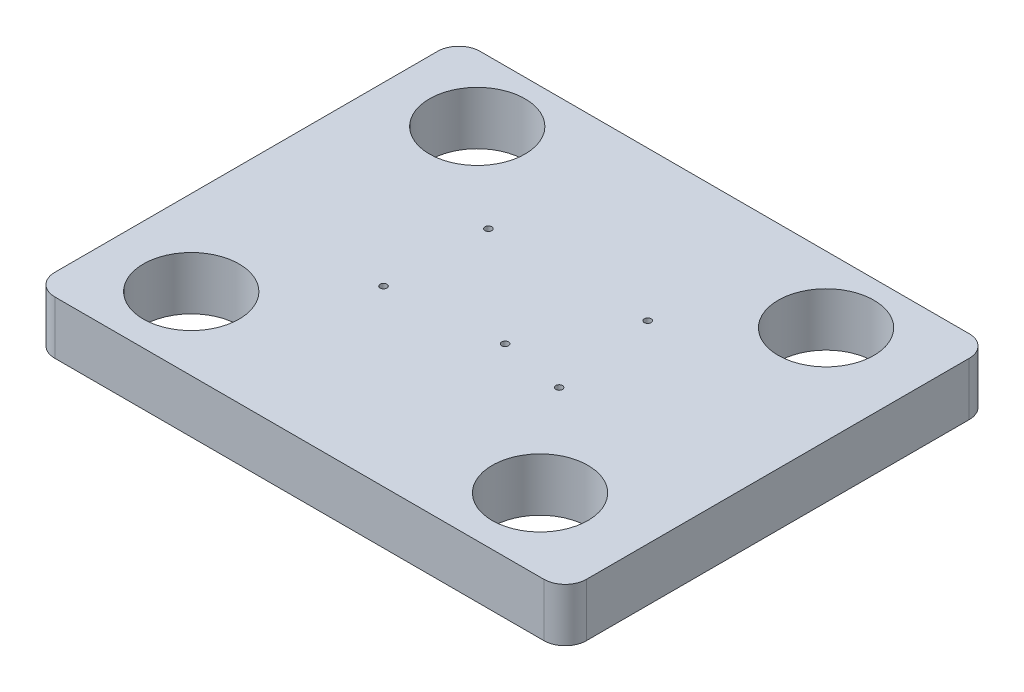
ISO-10303-21;
HEADER;
FILE_DESCRIPTION(('STEP AP214'),'2;1');
FILE_NAME('part.step','',(''),(''),'','','');
FILE_SCHEMA(('AUTOMOTIVE_DESIGN { 1 0 10303 214 1 1 1 1 }'));
ENDSEC;
DATA;
#1=APPLICATION_CONTEXT('core data for automotive mechanical design processes');
#2=APPLICATION_PROTOCOL_DEFINITION('international standard','automotive_design',2000,#1);
#3=PRODUCT_CONTEXT('',#1,'mechanical');
#4=PRODUCT('Part','Part','',(#3));
#5=PRODUCT_RELATED_PRODUCT_CATEGORY('part','',(#4));
#6=PRODUCT_DEFINITION_FORMATION('','',#4);
#7=PRODUCT_DEFINITION_CONTEXT('part definition',#1,'design');
#8=PRODUCT_DEFINITION('design','',#6,#7);
#9=PRODUCT_DEFINITION_SHAPE('','',#8);
#10=(LENGTH_UNIT() NAMED_UNIT(*) SI_UNIT(.MILLI.,.METRE.));
#11=(NAMED_UNIT(*) PLANE_ANGLE_UNIT() SI_UNIT($,.RADIAN.));
#12=(NAMED_UNIT(*) SI_UNIT($,.STERADIAN.) SOLID_ANGLE_UNIT());
#13=UNCERTAINTY_MEASURE_WITH_UNIT(LENGTH_MEASURE(1.E-05),#10,'distance_accuracy_value','');
#14=(GEOMETRIC_REPRESENTATION_CONTEXT(3) GLOBAL_UNCERTAINTY_ASSIGNED_CONTEXT((#13)) GLOBAL_UNIT_ASSIGNED_CONTEXT((#10,
#11,#12)) REPRESENTATION_CONTEXT('',''));
#15=CARTESIAN_POINT('',(0.,0.,0.));
#16=DIRECTION('',(0.,0.,1.));
#17=DIRECTION('',(1.,0.,0.));
#18=AXIS2_PLACEMENT_3D('',#15,#16,#17);
#19=CARTESIAN_POINT('',(9.99999999999995,25.,-190.));
#20=DIRECTION('',(0.,1.,0.));
#21=DIRECTION('',(0.,0.,1.));
#22=AXIS2_PLACEMENT_3D('',#19,#20,#21);
#23=CYLINDRICAL_SURFACE('',#22,10.);
#24=DIRECTION('',(0.,1.,0.));
#25=VECTOR('',#24,1.);
#26=CARTESIAN_POINT('',(9.99999999999995,25.,-200.));
#27=LINE('',#26,#25);
#28=CARTESIAN_POINT('',(9.99999999999995,0.,-200.));
#29=VERTEX_POINT('',#28);
#30=CARTESIAN_POINT('',(9.99999999999995,25.,-200.));
#31=VERTEX_POINT('',#30);
#32=EDGE_CURVE('E168',#29,#31,#27,.T.);
#33=ORIENTED_EDGE('',*,*,#32,.F.);
#34=CARTESIAN_POINT('',(9.99999999999995,0.,-190.));
#35=DIRECTION('',(0.,-1.,0.));
#36=DIRECTION('',(0.,0.,-1.));
#37=AXIS2_PLACEMENT_3D('',#34,#35,#36);
#38=CIRCLE('',#37,10.);
#39=CARTESIAN_POINT('',(0.,0.,-190.));
#40=VERTEX_POINT('',#39);
#41=EDGE_CURVE('E47',#40,#29,#38,.T.);
#42=ORIENTED_EDGE('',*,*,#41,.F.);
#43=DIRECTION('',(0.,1.,0.));
#44=VECTOR('',#43,1.);
#45=CARTESIAN_POINT('',(0.,25.,-190.));
#46=LINE('',#45,#44);
#47=CARTESIAN_POINT('',(0.,25.,-190.));
#48=VERTEX_POINT('',#47);
#49=EDGE_CURVE('E107',#48,#40,#46,.F.);
#50=ORIENTED_EDGE('',*,*,#49,.F.);
#51=CARTESIAN_POINT('',(9.99999999999995,25.,-190.));
#52=DIRECTION('',(0.,-1.,0.));
#53=DIRECTION('',(0.,0.,-1.));
#54=AXIS2_PLACEMENT_3D('',#51,#52,#53);
#55=CIRCLE('',#54,10.);
#56=EDGE_CURVE('E11',#31,#48,#55,.F.);
#57=ORIENTED_EDGE('',*,*,#56,.F.);
#58=EDGE_LOOP('',(#33,#42,#50,#57));
#59=FACE_BOUND('',#58,.T.);
#60=ADVANCED_FACE('F39',(#59),#23,.T.);
#61=CARTESIAN_POINT('',(240.,25.,-190.));
#62=DIRECTION('',(0.,1.,0.));
#63=DIRECTION('',(0.,0.,1.));
#64=AXIS2_PLACEMENT_3D('',#61,#62,#63);
#65=CYLINDRICAL_SURFACE('',#64,10.);
#66=DIRECTION('',(0.,1.,0.));
#67=VECTOR('',#66,1.);
#68=CARTESIAN_POINT('',(250.,25.,-190.));
#69=LINE('',#68,#67);
#70=CARTESIAN_POINT('',(250.,0.,-190.));
#71=VERTEX_POINT('',#70);
#72=CARTESIAN_POINT('',(250.,25.,-190.));
#73=VERTEX_POINT('',#72);
#74=EDGE_CURVE('E154',#71,#73,#69,.T.);
#75=ORIENTED_EDGE('',*,*,#74,.F.);
#76=CARTESIAN_POINT('',(240.,0.,-190.));
#77=DIRECTION('',(0.,-1.,0.));
#78=DIRECTION('',(0.,0.,-1.));
#79=AXIS2_PLACEMENT_3D('',#76,#77,#78);
#80=CIRCLE('',#79,10.);
#81=CARTESIAN_POINT('',(240.,0.,-200.));
#82=VERTEX_POINT('',#81);
#83=EDGE_CURVE('E162',#82,#71,#80,.T.);
#84=ORIENTED_EDGE('',*,*,#83,.F.);
#85=DIRECTION('',(0.,1.,0.));
#86=VECTOR('',#85,1.);
#87=CARTESIAN_POINT('',(240.,25.,-200.));
#88=LINE('',#87,#86);
#89=CARTESIAN_POINT('',(240.,25.,-200.));
#90=VERTEX_POINT('',#89);
#91=EDGE_CURVE('E158',#90,#82,#88,.F.);
#92=ORIENTED_EDGE('',*,*,#91,.F.);
#93=CARTESIAN_POINT('',(240.,25.,-190.));
#94=DIRECTION('',(0.,-1.,0.));
#95=DIRECTION('',(0.,0.,-1.));
#96=AXIS2_PLACEMENT_3D('',#93,#94,#95);
#97=CIRCLE('',#96,10.);
#98=EDGE_CURVE('E165',#73,#90,#97,.F.);
#99=ORIENTED_EDGE('',*,*,#98,.F.);
#100=EDGE_LOOP('',(#75,#84,#92,#99));
#101=FACE_BOUND('',#100,.T.);
#102=ADVANCED_FACE('F300',(#101),#65,.T.);
#103=CARTESIAN_POINT('',(240.,25.,-10.));
#104=DIRECTION('',(0.,1.,0.));
#105=DIRECTION('',(0.,0.,1.));
#106=AXIS2_PLACEMENT_3D('',#103,#104,#105);
#107=CYLINDRICAL_SURFACE('',#106,10.);
#108=DIRECTION('',(0.,1.,0.));
#109=VECTOR('',#108,1.);
#110=CARTESIAN_POINT('',(240.,25.,0.));
#111=LINE('',#110,#109);
#112=CARTESIAN_POINT('',(240.,0.,0.));
#113=VERTEX_POINT('',#112);
#114=CARTESIAN_POINT('',(240.,25.,0.));
#115=VERTEX_POINT('',#114);
#116=EDGE_CURVE('E140',#113,#115,#111,.T.);
#117=ORIENTED_EDGE('',*,*,#116,.F.);
#118=CARTESIAN_POINT('',(240.,0.,-10.));
#119=DIRECTION('',(0.,-1.,0.));
#120=DIRECTION('',(0.,0.,-1.));
#121=AXIS2_PLACEMENT_3D('',#118,#119,#120);
#122=CIRCLE('',#121,10.);
#123=CARTESIAN_POINT('',(250.,0.,-10.));
#124=VERTEX_POINT('',#123);
#125=EDGE_CURVE('E148',#124,#113,#122,.T.);
#126=ORIENTED_EDGE('',*,*,#125,.F.);
#127=DIRECTION('',(0.,1.,0.));
#128=VECTOR('',#127,1.);
#129=CARTESIAN_POINT('',(250.,25.,-10.));
#130=LINE('',#129,#128);
#131=CARTESIAN_POINT('',(250.,25.,-10.));
#132=VERTEX_POINT('',#131);
#133=EDGE_CURVE('E144',#132,#124,#130,.F.);
#134=ORIENTED_EDGE('',*,*,#133,.F.);
#135=CARTESIAN_POINT('',(240.,25.,-10.));
#136=DIRECTION('',(0.,-1.,0.));
#137=DIRECTION('',(0.,0.,-1.));
#138=AXIS2_PLACEMENT_3D('',#135,#136,#137);
#139=CIRCLE('',#138,10.);
#140=EDGE_CURVE('E151',#115,#132,#139,.F.);
#141=ORIENTED_EDGE('',*,*,#140,.F.);
#142=EDGE_LOOP('',(#117,#126,#134,#141));
#143=FACE_BOUND('',#142,.T.);
#144=ADVANCED_FACE('F304',(#143),#107,.T.);
#145=CARTESIAN_POINT('',(10.,25.,-10.));
#146=DIRECTION('',(0.,1.,0.));
#147=DIRECTION('',(0.,0.,1.));
#148=AXIS2_PLACEMENT_3D('',#145,#146,#147);
#149=CYLINDRICAL_SURFACE('',#148,10.);
#150=DIRECTION('',(0.,1.,0.));
#151=VECTOR('',#150,1.);
#152=CARTESIAN_POINT('',(0.,25.,-10.));
#153=LINE('',#152,#151);
#154=CARTESIAN_POINT('',(0.,0.,-10.));
#155=VERTEX_POINT('',#154);
#156=CARTESIAN_POINT('',(0.,25.,-10.));
#157=VERTEX_POINT('',#156);
#158=EDGE_CURVE('E106',#155,#157,#153,.T.);
#159=ORIENTED_EDGE('',*,*,#158,.F.);
#160=CARTESIAN_POINT('',(10.,0.,-10.));
#161=DIRECTION('',(0.,-1.,0.));
#162=DIRECTION('',(0.,0.,-1.));
#163=AXIS2_PLACEMENT_3D('',#160,#161,#162);
#164=CIRCLE('',#163,10.);
#165=CARTESIAN_POINT('',(10.,0.,0.));
#166=VERTEX_POINT('',#165);
#167=EDGE_CURVE('E114',#166,#155,#164,.T.);
#168=ORIENTED_EDGE('',*,*,#167,.F.);
#169=DIRECTION('',(0.,1.,0.));
#170=VECTOR('',#169,1.);
#171=CARTESIAN_POINT('',(10.,25.,0.));
#172=LINE('',#171,#170);
#173=CARTESIAN_POINT('',(10.,25.,0.));
#174=VERTEX_POINT('',#173);
#175=EDGE_CURVE('E122',#174,#166,#172,.F.);
#176=ORIENTED_EDGE('',*,*,#175,.F.);
#177=CARTESIAN_POINT('',(10.,25.,-10.));
#178=DIRECTION('',(0.,-1.,0.));
#179=DIRECTION('',(0.,0.,-1.));
#180=AXIS2_PLACEMENT_3D('',#177,#178,#179);
#181=CIRCLE('',#180,10.);
#182=EDGE_CURVE('E121',#157,#174,#181,.F.);
#183=ORIENTED_EDGE('',*,*,#182,.F.);
#184=EDGE_LOOP('',(#159,#168,#176,#183));
#185=FACE_BOUND('',#184,.T.);
#186=ADVANCED_FACE('F125',(#185),#149,.T.);
#187=CARTESIAN_POINT('',(0.,25.,0.));
#188=DIRECTION('',(1.,0.,0.));
#189=DIRECTION('',(0.,0.,-1.));
#190=AXIS2_PLACEMENT_3D('',#187,#188,#189);
#191=PLANE('',#190);
#192=DIRECTION('',(0.,0.,1.));
#193=VECTOR('',#192,1.);
#194=CARTESIAN_POINT('',(0.,25.,0.));
#195=LINE('',#194,#193);
#196=EDGE_CURVE('E181',#48,#157,#195,.T.);
#197=ORIENTED_EDGE('',*,*,#196,.F.);
#198=ORIENTED_EDGE('',*,*,#49,.T.);
#199=DIRECTION('',(0.,0.,1.));
#200=VECTOR('',#199,1.);
#201=CARTESIAN_POINT('',(0.,0.,0.));
#202=LINE('',#201,#200);
#203=EDGE_CURVE('E101',#40,#155,#202,.T.);
#204=ORIENTED_EDGE('',*,*,#203,.T.);
#205=ORIENTED_EDGE('',*,*,#158,.T.);
#206=EDGE_LOOP('',(#197,#198,#204,#205));
#207=FACE_BOUND('',#206,.T.);
#208=ADVANCED_FACE('F104',(#207),#191,.F.);
#209=CARTESIAN_POINT('',(0.,25.,0.));
#210=DIRECTION('',(0.,0.,-1.));
#211=DIRECTION('',(-1.,0.,0.));
#212=AXIS2_PLACEMENT_3D('',#209,#210,#211);
#213=PLANE('',#212);
#214=DIRECTION('',(1.,0.,0.));
#215=VECTOR('',#214,1.);
#216=CARTESIAN_POINT('',(0.,0.,0.));
#217=LINE('',#216,#215);
#218=EDGE_CURVE('E110',#166,#113,#217,.T.);
#219=ORIENTED_EDGE('',*,*,#218,.T.);
#220=ORIENTED_EDGE('',*,*,#116,.T.);
#221=DIRECTION('',(1.,0.,0.));
#222=VECTOR('',#221,1.);
#223=CARTESIAN_POINT('',(0.,25.,0.));
#224=LINE('',#223,#222);
#225=EDGE_CURVE('E185',#174,#115,#224,.T.);
#226=ORIENTED_EDGE('',*,*,#225,.F.);
#227=ORIENTED_EDGE('',*,*,#175,.T.);
#228=EDGE_LOOP('',(#219,#220,#226,#227));
#229=FACE_BOUND('',#228,.T.);
#230=ADVANCED_FACE('F307',(#229),#213,.F.);
#231=CARTESIAN_POINT('',(250.,25.,0.));
#232=DIRECTION('',(-1.,0.,0.));
#233=DIRECTION('',(0.,0.,1.));
#234=AXIS2_PLACEMENT_3D('',#231,#232,#233);
#235=PLANE('',#234);
#236=DIRECTION('',(0.,0.,-1.));
#237=VECTOR('',#236,1.);
#238=CARTESIAN_POINT('',(250.,0.,0.));
#239=LINE('',#238,#237);
#240=EDGE_CURVE('E182',#124,#71,#239,.T.);
#241=ORIENTED_EDGE('',*,*,#240,.T.);
#242=ORIENTED_EDGE('',*,*,#74,.T.);
#243=DIRECTION('',(0.,0.,-1.));
#244=VECTOR('',#243,1.);
#245=CARTESIAN_POINT('',(250.,25.,0.));
#246=LINE('',#245,#244);
#247=EDGE_CURVE('E132',#132,#73,#246,.T.);
#248=ORIENTED_EDGE('',*,*,#247,.F.);
#249=ORIENTED_EDGE('',*,*,#133,.T.);
#250=EDGE_LOOP('',(#241,#242,#248,#249));
#251=FACE_BOUND('',#250,.T.);
#252=ADVANCED_FACE('F308',(#251),#235,.F.);
#253=CARTESIAN_POINT('',(0.,25.,-200.));
#254=DIRECTION('',(0.,0.,1.));
#255=DIRECTION('',(1.,0.,0.));
#256=AXIS2_PLACEMENT_3D('',#253,#254,#255);
#257=PLANE('',#256);
#258=DIRECTION('',(-1.,0.,0.));
#259=VECTOR('',#258,1.);
#260=CARTESIAN_POINT('',(0.,0.,-200.));
#261=LINE('',#260,#259);
#262=EDGE_CURVE('E135',#82,#29,#261,.T.);
#263=ORIENTED_EDGE('',*,*,#262,.T.);
#264=ORIENTED_EDGE('',*,*,#32,.T.);
#265=DIRECTION('',(-1.,0.,0.));
#266=VECTOR('',#265,1.);
#267=CARTESIAN_POINT('',(0.,25.,-200.));
#268=LINE('',#267,#266);
#269=EDGE_CURVE('E127',#90,#31,#268,.T.);
#270=ORIENTED_EDGE('',*,*,#269,.F.);
#271=ORIENTED_EDGE('',*,*,#91,.T.);
#272=EDGE_LOOP('',(#263,#264,#270,#271));
#273=FACE_BOUND('',#272,.T.);
#274=ADVANCED_FACE('F178',(#273),#257,.F.);
#275=CARTESIAN_POINT('',(0.,25.,0.));
#276=DIRECTION('',(0.,-1.,0.));
#277=DIRECTION('',(0.,0.,-1.));
#278=AXIS2_PLACEMENT_3D('',#275,#276,#277);
#279=PLANE('',#278);
#280=CARTESIAN_POINT('',(39.9103974749629,25.,-168.750387859964));
#281=DIRECTION('',(0.,1.,0.));
#282=DIRECTION('',(0.,0.,1.));
#283=AXIS2_PLACEMENT_3D('',#280,#281,#282);
#284=CIRCLE('',#283,22.5);
#285=CARTESIAN_POINT('',(39.9103974749629,25.,-146.250387859964));
#286=VERTEX_POINT('',#285);
#287=EDGE_CURVE('E247',#286,#286,#284,.T.);
#288=ORIENTED_EDGE('',*,*,#287,.F.);
#289=EDGE_LOOP('',(#288));
#290=FACE_BOUND('',#289,.T.);
#291=CARTESIAN_POINT('',(39.9103974749629,25.,-34.2660825397425));
#292=DIRECTION('',(0.,1.,0.));
#293=DIRECTION('',(0.,0.,1.));
#294=AXIS2_PLACEMENT_3D('',#291,#292,#293);
#295=CIRCLE('',#294,22.5);
#296=CARTESIAN_POINT('',(39.9103974749629,25.,-11.7660825397425));
#297=VERTEX_POINT('',#296);
#298=EDGE_CURVE('E255',#297,#297,#295,.T.);
#299=ORIENTED_EDGE('',*,*,#298,.F.);
#300=EDGE_LOOP('',(#299));
#301=FACE_BOUND('',#300,.T.);
#302=CARTESIAN_POINT('',(203.930975458971,25.,-34.2660825397425));
#303=DIRECTION('',(0.,1.,0.));
#304=DIRECTION('',(0.,0.,1.));
#305=AXIS2_PLACEMENT_3D('',#302,#303,#304);
#306=CIRCLE('',#305,22.5);
#307=CARTESIAN_POINT('',(203.930975458971,25.,-11.7660825397425));
#308=VERTEX_POINT('',#307);
#309=EDGE_CURVE('E263',#308,#308,#306,.T.);
#310=ORIENTED_EDGE('',*,*,#309,.F.);
#311=EDGE_LOOP('',(#310));
#312=FACE_BOUND('',#311,.T.);
#313=CARTESIAN_POINT('',(203.930975458971,25.,-168.750387859964));
#314=DIRECTION('',(0.,1.,0.));
#315=DIRECTION('',(0.,0.,1.));
#316=AXIS2_PLACEMENT_3D('',#313,#314,#315);
#317=CIRCLE('',#316,22.5);
#318=CARTESIAN_POINT('',(203.930975458971,25.,-146.250387859964));
#319=VERTEX_POINT('',#318);
#320=EDGE_CURVE('E239',#319,#319,#317,.T.);
#321=ORIENTED_EDGE('',*,*,#320,.F.);
#322=EDGE_LOOP('',(#321));
#323=FACE_BOUND('',#322,.T.);
#324=CARTESIAN_POINT('',(134.983925072132,25.,-86.7560797353676));
#325=DIRECTION('',(0.,1.,0.));
#326=DIRECTION('',(0.,0.,1.));
#327=AXIS2_PLACEMENT_3D('',#324,#325,#326);
#328=CIRCLE('',#327,1.60000000000002);
#329=CARTESIAN_POINT('',(134.983925072132,25.,-85.1560797353676));
#330=VERTEX_POINT('',#329);
#331=EDGE_CURVE('E211',#330,#330,#328,.T.);
#332=ORIENTED_EDGE('',*,*,#331,.F.);
#333=EDGE_LOOP('',(#332));
#334=FACE_BOUND('',#333,.T.);
#335=CARTESIAN_POINT('',(165.463925072132,25.,-81.6760797353676));
#336=DIRECTION('',(0.,1.,0.));
#337=DIRECTION('',(0.,0.,1.));
#338=AXIS2_PLACEMENT_3D('',#335,#336,#337);
#339=CIRCLE('',#338,1.60000000000002);
#340=CARTESIAN_POINT('',(165.463925072132,25.,-80.0760797353676));
#341=VERTEX_POINT('',#340);
#342=EDGE_CURVE('E220',#341,#341,#339,.T.);
#343=ORIENTED_EDGE('',*,*,#342,.F.);
#344=EDGE_LOOP('',(#343));
#345=FACE_BOUND('',#344,.T.);
#346=CARTESIAN_POINT('',(159.113925072132,25.,-129.712061315759));
#347=DIRECTION('',(0.,1.,0.));
#348=DIRECTION('',(0.,0.,1.));
#349=AXIS2_PLACEMENT_3D('',#346,#347,#348);
#350=CIRCLE('',#349,1.59999999999999);
#351=CARTESIAN_POINT('',(159.113925072132,25.,-128.112061315759));
#352=VERTEX_POINT('',#351);
#353=EDGE_CURVE('E228',#352,#352,#350,.T.);
#354=ORIENTED_EDGE('',*,*,#353,.F.);
#355=EDGE_LOOP('',(#354));
#356=FACE_BOUND('',#355,.T.);
#357=CARTESIAN_POINT('',(84.1839250721321,25.,-129.712061315759));
#358=DIRECTION('',(0.,1.,0.));
#359=DIRECTION('',(0.,0.,1.));
#360=AXIS2_PLACEMENT_3D('',#357,#358,#359);
#361=CIRCLE('',#360,1.59999999999999);
#362=CARTESIAN_POINT('',(84.1839250721321,25.,-128.112061315759));
#363=VERTEX_POINT('',#362);
#364=EDGE_CURVE('E203',#363,#363,#361,.T.);
#365=ORIENTED_EDGE('',*,*,#364,.F.);
#366=EDGE_LOOP('',(#365));
#367=FACE_BOUND('',#366,.T.);
#368=CARTESIAN_POINT('',(82.9139250721321,25.,-81.6760797353676));
#369=DIRECTION('',(0.,1.,0.));
#370=DIRECTION('',(0.,0.,1.));
#371=AXIS2_PLACEMENT_3D('',#368,#369,#370);
#372=CIRCLE('',#371,1.59999999999999);
#373=CARTESIAN_POINT('',(82.9139250721321,25.,-80.0760797353676));
#374=VERTEX_POINT('',#373);
#375=EDGE_CURVE('E199',#374,#374,#372,.T.);
#376=ORIENTED_EDGE('',*,*,#375,.F.);
#377=EDGE_LOOP('',(#376));
#378=FACE_BOUND('',#377,.T.);
#379=ORIENTED_EDGE('',*,*,#269,.T.);
#380=ORIENTED_EDGE('',*,*,#56,.T.);
#381=ORIENTED_EDGE('',*,*,#196,.T.);
#382=ORIENTED_EDGE('',*,*,#182,.T.);
#383=ORIENTED_EDGE('',*,*,#225,.T.);
#384=ORIENTED_EDGE('',*,*,#140,.T.);
#385=ORIENTED_EDGE('',*,*,#247,.T.);
#386=ORIENTED_EDGE('',*,*,#98,.T.);
#387=EDGE_LOOP('',(#379,#380,#381,#382,#383,#384,#385,#386));
#388=FACE_BOUND('',#387,.T.);
#389=ADVANCED_FACE('F281',(#290,#301,#312,#323,#334,#345,#356,#367,#378,#388),#279,.F.);
#390=CARTESIAN_POINT('',(0.,0.,0.));
#391=DIRECTION('',(0.,-1.,0.));
#392=DIRECTION('',(0.,0.,-1.));
#393=AXIS2_PLACEMENT_3D('',#390,#391,#392);
#394=PLANE('',#393);
#395=CARTESIAN_POINT('',(39.9103974749629,0.,-168.750387859964));
#396=DIRECTION('',(0.,1.,0.));
#397=DIRECTION('',(0.,0.,1.));
#398=AXIS2_PLACEMENT_3D('',#395,#396,#397);
#399=CIRCLE('',#398,22.5);
#400=CARTESIAN_POINT('',(39.9103974749629,0.,-146.250387859964));
#401=VERTEX_POINT('',#400);
#402=EDGE_CURVE('E251',#401,#401,#399,.T.);
#403=ORIENTED_EDGE('',*,*,#402,.T.);
#404=EDGE_LOOP('',(#403));
#405=FACE_BOUND('',#404,.T.);
#406=CARTESIAN_POINT('',(39.9103974749629,0.,-34.2660825397425));
#407=DIRECTION('',(0.,1.,0.));
#408=DIRECTION('',(0.,0.,1.));
#409=AXIS2_PLACEMENT_3D('',#406,#407,#408);
#410=CIRCLE('',#409,22.5);
#411=CARTESIAN_POINT('',(39.9103974749629,0.,-11.7660825397425));
#412=VERTEX_POINT('',#411);
#413=EDGE_CURVE('E259',#412,#412,#410,.T.);
#414=ORIENTED_EDGE('',*,*,#413,.T.);
#415=EDGE_LOOP('',(#414));
#416=FACE_BOUND('',#415,.T.);
#417=CARTESIAN_POINT('',(203.930975458971,0.,-34.2660825397425));
#418=DIRECTION('',(0.,1.,0.));
#419=DIRECTION('',(0.,0.,1.));
#420=AXIS2_PLACEMENT_3D('',#417,#418,#419);
#421=CIRCLE('',#420,22.5);
#422=CARTESIAN_POINT('',(203.930975458971,0.,-11.7660825397425));
#423=VERTEX_POINT('',#422);
#424=EDGE_CURVE('E243',#423,#423,#421,.T.);
#425=ORIENTED_EDGE('',*,*,#424,.T.);
#426=EDGE_LOOP('',(#425));
#427=FACE_BOUND('',#426,.T.);
#428=CARTESIAN_POINT('',(203.930975458971,0.,-168.750387859964));
#429=DIRECTION('',(0.,1.,0.));
#430=DIRECTION('',(0.,0.,1.));
#431=AXIS2_PLACEMENT_3D('',#428,#429,#430);
#432=CIRCLE('',#431,22.5);
#433=CARTESIAN_POINT('',(203.930975458971,0.,-146.250387859964));
#434=VERTEX_POINT('',#433);
#435=EDGE_CURVE('E212',#434,#434,#432,.T.);
#436=ORIENTED_EDGE('',*,*,#435,.T.);
#437=EDGE_LOOP('',(#436));
#438=FACE_BOUND('',#437,.T.);
#439=CARTESIAN_POINT('',(134.983925072132,0.,-86.7560797353676));
#440=DIRECTION('',(0.,1.,0.));
#441=DIRECTION('',(0.,0.,1.));
#442=AXIS2_PLACEMENT_3D('',#439,#440,#441);
#443=CIRCLE('',#442,1.60000000000002);
#444=CARTESIAN_POINT('',(134.983925072132,0.,-85.1560797353676));
#445=VERTEX_POINT('',#444);
#446=EDGE_CURVE('E207',#445,#445,#443,.T.);
#447=ORIENTED_EDGE('',*,*,#446,.T.);
#448=EDGE_LOOP('',(#447));
#449=FACE_BOUND('',#448,.T.);
#450=CARTESIAN_POINT('',(165.463925072132,0.,-81.6760797353676));
#451=DIRECTION('',(0.,1.,0.));
#452=DIRECTION('',(0.,0.,1.));
#453=AXIS2_PLACEMENT_3D('',#450,#451,#452);
#454=CIRCLE('',#453,1.60000000000002);
#455=CARTESIAN_POINT('',(165.463925072132,0.,-80.0760797353676));
#456=VERTEX_POINT('',#455);
#457=EDGE_CURVE('E216',#456,#456,#454,.T.);
#458=ORIENTED_EDGE('',*,*,#457,.T.);
#459=EDGE_LOOP('',(#458));
#460=FACE_BOUND('',#459,.T.);
#461=CARTESIAN_POINT('',(159.113925072132,0.,-129.712061315759));
#462=DIRECTION('',(0.,1.,0.));
#463=DIRECTION('',(0.,0.,1.));
#464=AXIS2_PLACEMENT_3D('',#461,#462,#463);
#465=CIRCLE('',#464,1.59999999999999);
#466=CARTESIAN_POINT('',(159.113925072132,0.,-128.112061315759));
#467=VERTEX_POINT('',#466);
#468=EDGE_CURVE('E224',#467,#467,#465,.T.);
#469=ORIENTED_EDGE('',*,*,#468,.T.);
#470=EDGE_LOOP('',(#469));
#471=FACE_BOUND('',#470,.T.);
#472=CARTESIAN_POINT('',(84.1839250721321,0.,-129.712061315759));
#473=DIRECTION('',(0.,1.,0.));
#474=DIRECTION('',(0.,0.,1.));
#475=AXIS2_PLACEMENT_3D('',#472,#473,#474);
#476=CIRCLE('',#475,1.59999999999999);
#477=CARTESIAN_POINT('',(84.1839250721321,0.,-128.112061315759));
#478=VERTEX_POINT('',#477);
#479=EDGE_CURVE('E232',#478,#478,#476,.T.);
#480=ORIENTED_EDGE('',*,*,#479,.T.);
#481=EDGE_LOOP('',(#480));
#482=FACE_BOUND('',#481,.T.);
#483=CARTESIAN_POINT('',(82.9139250721321,0.,-81.6760797353676));
#484=DIRECTION('',(0.,1.,0.));
#485=DIRECTION('',(0.,0.,1.));
#486=AXIS2_PLACEMENT_3D('',#483,#484,#485);
#487=CIRCLE('',#486,1.59999999999999);
#488=CARTESIAN_POINT('',(82.9139250721321,0.,-80.0760797353676));
#489=VERTEX_POINT('',#488);
#490=EDGE_CURVE('E111',#489,#489,#487,.T.);
#491=ORIENTED_EDGE('',*,*,#490,.T.);
#492=EDGE_LOOP('',(#491));
#493=FACE_BOUND('',#492,.T.);
#494=ORIENTED_EDGE('',*,*,#203,.F.);
#495=ORIENTED_EDGE('',*,*,#41,.T.);
#496=ORIENTED_EDGE('',*,*,#262,.F.);
#497=ORIENTED_EDGE('',*,*,#83,.T.);
#498=ORIENTED_EDGE('',*,*,#240,.F.);
#499=ORIENTED_EDGE('',*,*,#125,.T.);
#500=ORIENTED_EDGE('',*,*,#218,.F.);
#501=ORIENTED_EDGE('',*,*,#167,.T.);
#502=EDGE_LOOP('',(#494,#495,#496,#497,#498,#499,#500,#501));
#503=FACE_BOUND('',#502,.T.);
#504=ADVANCED_FACE('F115',(#405,#416,#427,#438,#449,#460,#471,#482,#493,#503),#394,.T.);
#505=CARTESIAN_POINT('',(82.9139250721321,0.,-81.6760797353676));
#506=DIRECTION('',(0.,1.,0.));
#507=DIRECTION('',(0.,0.,1.));
#508=AXIS2_PLACEMENT_3D('',#505,#506,#507);
#509=CYLINDRICAL_SURFACE('',#508,1.59999999999999);
#510=ORIENTED_EDGE('',*,*,#490,.F.);
#511=EDGE_LOOP('',(#510));
#512=FACE_BOUND('',#511,.T.);
#513=ORIENTED_EDGE('',*,*,#375,.T.);
#514=EDGE_LOOP('',(#513));
#515=FACE_BOUND('',#514,.T.);
#516=ADVANCED_FACE('F359',(#512,#515),#509,.F.);
#517=CARTESIAN_POINT('',(84.1839250721321,0.,-129.712061315759));
#518=DIRECTION('',(0.,1.,0.));
#519=DIRECTION('',(0.,0.,1.));
#520=AXIS2_PLACEMENT_3D('',#517,#518,#519);
#521=CYLINDRICAL_SURFACE('',#520,1.59999999999999);
#522=ORIENTED_EDGE('',*,*,#479,.F.);
#523=EDGE_LOOP('',(#522));
#524=FACE_BOUND('',#523,.T.);
#525=ORIENTED_EDGE('',*,*,#364,.T.);
#526=EDGE_LOOP('',(#525));
#527=FACE_BOUND('',#526,.T.);
#528=ADVANCED_FACE('F365',(#524,#527),#521,.F.);
#529=CARTESIAN_POINT('',(159.113925072132,0.,-129.712061315759));
#530=DIRECTION('',(0.,1.,0.));
#531=DIRECTION('',(0.,0.,1.));
#532=AXIS2_PLACEMENT_3D('',#529,#530,#531);
#533=CYLINDRICAL_SURFACE('',#532,1.59999999999999);
#534=ORIENTED_EDGE('',*,*,#468,.F.);
#535=EDGE_LOOP('',(#534));
#536=FACE_BOUND('',#535,.T.);
#537=ORIENTED_EDGE('',*,*,#353,.T.);
#538=EDGE_LOOP('',(#537));
#539=FACE_BOUND('',#538,.T.);
#540=ADVANCED_FACE('F374',(#536,#539),#533,.F.);
#541=CARTESIAN_POINT('',(165.463925072132,0.,-81.6760797353676));
#542=DIRECTION('',(0.,1.,0.));
#543=DIRECTION('',(0.,0.,1.));
#544=AXIS2_PLACEMENT_3D('',#541,#542,#543);
#545=CYLINDRICAL_SURFACE('',#544,1.60000000000002);
#546=ORIENTED_EDGE('',*,*,#457,.F.);
#547=EDGE_LOOP('',(#546));
#548=FACE_BOUND('',#547,.T.);
#549=ORIENTED_EDGE('',*,*,#342,.T.);
#550=EDGE_LOOP('',(#549));
#551=FACE_BOUND('',#550,.T.);
#552=ADVANCED_FACE('F383',(#548,#551),#545,.F.);
#553=CARTESIAN_POINT('',(134.983925072132,0.,-86.7560797353676));
#554=DIRECTION('',(0.,1.,0.));
#555=DIRECTION('',(0.,0.,1.));
#556=AXIS2_PLACEMENT_3D('',#553,#554,#555);
#557=CYLINDRICAL_SURFACE('',#556,1.60000000000002);
#558=ORIENTED_EDGE('',*,*,#446,.F.);
#559=EDGE_LOOP('',(#558));
#560=FACE_BOUND('',#559,.T.);
#561=ORIENTED_EDGE('',*,*,#331,.T.);
#562=EDGE_LOOP('',(#561));
#563=FACE_BOUND('',#562,.T.);
#564=ADVANCED_FACE('F392',(#560,#563),#557,.F.);
#565=CARTESIAN_POINT('',(203.930975458971,0.,-168.750387859964));
#566=DIRECTION('',(0.,1.,0.));
#567=DIRECTION('',(0.,0.,1.));
#568=AXIS2_PLACEMENT_3D('',#565,#566,#567);
#569=CYLINDRICAL_SURFACE('',#568,22.5);
#570=ORIENTED_EDGE('',*,*,#435,.F.);
#571=EDGE_LOOP('',(#570));
#572=FACE_BOUND('',#571,.T.);
#573=ORIENTED_EDGE('',*,*,#320,.T.);
#574=EDGE_LOOP('',(#573));
#575=FACE_BOUND('',#574,.T.);
#576=ADVANCED_FACE('F277',(#572,#575),#569,.F.);
#577=CARTESIAN_POINT('',(203.930975458971,0.,-34.2660825397425));
#578=DIRECTION('',(0.,1.,0.));
#579=DIRECTION('',(0.,0.,1.));
#580=AXIS2_PLACEMENT_3D('',#577,#578,#579);
#581=CYLINDRICAL_SURFACE('',#580,22.5);
#582=ORIENTED_EDGE('',*,*,#424,.F.);
#583=EDGE_LOOP('',(#582));
#584=FACE_BOUND('',#583,.T.);
#585=ORIENTED_EDGE('',*,*,#309,.T.);
#586=EDGE_LOOP('',(#585));
#587=FACE_BOUND('',#586,.T.);
#588=ADVANCED_FACE('F273',(#584,#587),#581,.F.);
#589=CARTESIAN_POINT('',(39.9103974749629,0.,-34.2660825397425));
#590=DIRECTION('',(0.,1.,0.));
#591=DIRECTION('',(0.,0.,1.));
#592=AXIS2_PLACEMENT_3D('',#589,#590,#591);
#593=CYLINDRICAL_SURFACE('',#592,22.5);
#594=ORIENTED_EDGE('',*,*,#413,.F.);
#595=EDGE_LOOP('',(#594));
#596=FACE_BOUND('',#595,.T.);
#597=ORIENTED_EDGE('',*,*,#298,.T.);
#598=EDGE_LOOP('',(#597));
#599=FACE_BOUND('',#598,.T.);
#600=ADVANCED_FACE('F276',(#596,#599),#593,.F.);
#601=CARTESIAN_POINT('',(39.9103974749629,0.,-168.750387859964));
#602=DIRECTION('',(0.,1.,0.));
#603=DIRECTION('',(0.,0.,1.));
#604=AXIS2_PLACEMENT_3D('',#601,#602,#603);
#605=CYLINDRICAL_SURFACE('',#604,22.5);
#606=ORIENTED_EDGE('',*,*,#402,.F.);
#607=EDGE_LOOP('',(#606));
#608=FACE_BOUND('',#607,.T.);
#609=ORIENTED_EDGE('',*,*,#287,.T.);
#610=EDGE_LOOP('',(#609));
#611=FACE_BOUND('',#610,.T.);
#612=ADVANCED_FACE('F424',(#608,#611),#605,.F.);
#613=CLOSED_SHELL('',(#60,#102,#144,#186,#208,#230,#252,#274,#389,#504,#516,#528,#540,#552,#564,
#576,#588,#600,#612));
#614=MANIFOLD_SOLID_BREP('B2',#613);
#615=ADVANCED_BREP_SHAPE_REPRESENTATION('',(#18,#614),#14);
#616=SHAPE_DEFINITION_REPRESENTATION(#9,#615);
ENDSEC;
END-ISO-10303-21;
